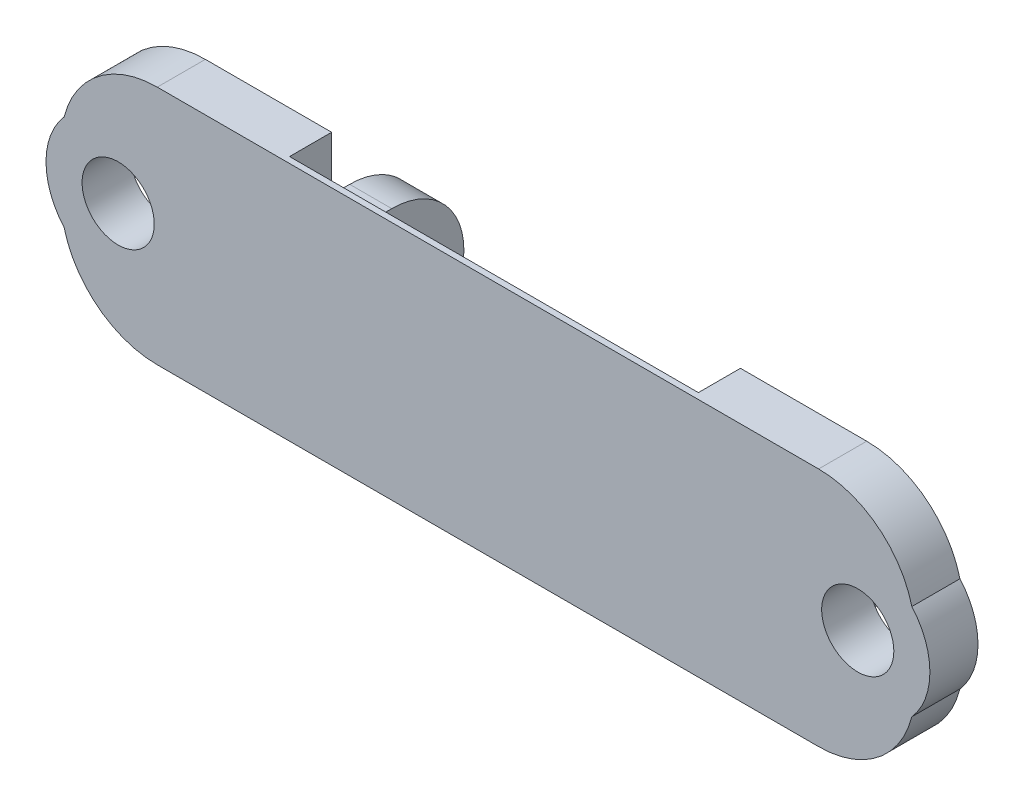
ISO-10303-21;
HEADER;
FILE_DESCRIPTION(('STEP AP214'),'2;1');
FILE_NAME('part.step','',(''),(''),'','','');
FILE_SCHEMA(('AUTOMOTIVE_DESIGN { 1 0 10303 214 1 1 1 1 }'));
ENDSEC;
DATA;
#1=APPLICATION_CONTEXT('core data for automotive mechanical design processes');
#2=APPLICATION_PROTOCOL_DEFINITION('international standard','automotive_design',2000,#1);
#3=PRODUCT_CONTEXT('',#1,'mechanical');
#4=PRODUCT('Part','Part','',(#3));
#5=PRODUCT_RELATED_PRODUCT_CATEGORY('part','',(#4));
#6=PRODUCT_DEFINITION_FORMATION('','',#4);
#7=PRODUCT_DEFINITION_CONTEXT('part definition',#1,'design');
#8=PRODUCT_DEFINITION('design','',#6,#7);
#9=PRODUCT_DEFINITION_SHAPE('','',#8);
#10=(LENGTH_UNIT() NAMED_UNIT(*) SI_UNIT(.MILLI.,.METRE.));
#11=(NAMED_UNIT(*) PLANE_ANGLE_UNIT() SI_UNIT($,.RADIAN.));
#12=(NAMED_UNIT(*) SI_UNIT($,.STERADIAN.) SOLID_ANGLE_UNIT());
#13=UNCERTAINTY_MEASURE_WITH_UNIT(LENGTH_MEASURE(1.E-05),#10,'distance_accuracy_value','');
#14=(GEOMETRIC_REPRESENTATION_CONTEXT(3) GLOBAL_UNCERTAINTY_ASSIGNED_CONTEXT((#13)) GLOBAL_UNIT_ASSIGNED_CONTEXT((#10,
#11,#12)) REPRESENTATION_CONTEXT('',''));
#15=CARTESIAN_POINT('',(0.,0.,0.));
#16=DIRECTION('',(0.,0.,1.));
#17=DIRECTION('',(1.,0.,0.));
#18=AXIS2_PLACEMENT_3D('',#15,#16,#17);
#19=CARTESIAN_POINT('',(0.,0.,-4.));
#20=DIRECTION('',(0.,0.,1.));
#21=DIRECTION('',(1.,0.,0.));
#22=AXIS2_PLACEMENT_3D('',#19,#20,#21);
#23=PLANE('',#22);
#24=CARTESIAN_POINT('',(66.254,10.,-4.));
#25=DIRECTION('',(0.,0.,1.));
#26=DIRECTION('',(1.,0.,0.));
#27=AXIS2_PLACEMENT_3D('',#24,#25,#26);
#28=CIRCLE('',#27,3.00000000000001);
#29=CARTESIAN_POINT('',(69.254,10.,-4.));
#30=VERTEX_POINT('',#29);
#31=EDGE_CURVE('E248',#30,#30,#28,.F.);
#32=ORIENTED_EDGE('',*,*,#31,.F.);
#33=EDGE_LOOP('',(#32));
#34=FACE_BOUND('',#33,.T.);
#35=DIRECTION('',(0.,-1.,0.));
#36=VECTOR('',#35,1.);
#37=CARTESIAN_POINT('',(56.,12.,-4.));
#38=LINE('',#37,#36);
#39=CARTESIAN_POINT('',(56.,12.,-4.));
#40=VERTEX_POINT('',#39);
#41=CARTESIAN_POINT('',(56.,0.,-4.));
#42=VERTEX_POINT('',#41);
#43=EDGE_CURVE('E166',#40,#42,#38,.T.);
#44=ORIENTED_EDGE('',*,*,#43,.F.);
#45=DIRECTION('',(-1.,0.,0.));
#46=VECTOR('',#45,1.);
#47=CARTESIAN_POINT('',(56.,12.,-4.));
#48=LINE('',#47,#46);
#49=CARTESIAN_POINT('',(52.5,12.,-4.));
#50=VERTEX_POINT('',#49);
#51=EDGE_CURVE('E53',#40,#50,#48,.T.);
#52=ORIENTED_EDGE('',*,*,#51,.T.);
#53=DIRECTION('',(0.,1.,0.));
#54=VECTOR('',#53,1.);
#55=CARTESIAN_POINT('',(52.5,0.,-4.));
#56=LINE('',#55,#54);
#57=CARTESIAN_POINT('',(52.5,20.,-4.));
#58=VERTEX_POINT('',#57);
#59=EDGE_CURVE('E242',#50,#58,#56,.T.);
#60=ORIENTED_EDGE('',*,*,#59,.T.);
#61=DIRECTION('',(1.,0.,0.));
#62=VECTOR('',#61,1.);
#63=CARTESIAN_POINT('',(0.,20.,-4.));
#64=LINE('',#63,#62);
#65=CARTESIAN_POINT('',(62.9999999999999,20.,-4.));
#66=VERTEX_POINT('',#65);
#67=EDGE_CURVE('E240',#58,#66,#64,.T.);
#68=ORIENTED_EDGE('',*,*,#67,.T.);
#69=CARTESIAN_POINT('',(63.,12.,-4.));
#70=DIRECTION('',(0.,0.,1.));
#71=DIRECTION('',(1.,0.,0.));
#72=AXIS2_PLACEMENT_3D('',#69,#70,#71);
#73=CIRCLE('',#72,8.);
#74=CARTESIAN_POINT('',(70.7539992634981,13.9686278017114,-4.));
#75=VERTEX_POINT('',#74);
#76=EDGE_CURVE('E237',#66,#75,#73,.F.);
#77=ORIENTED_EDGE('',*,*,#76,.T.);
#78=CARTESIAN_POINT('',(66.254,10.,-4.));
#79=DIRECTION('',(0.,0.,1.));
#80=DIRECTION('',(1.,0.,0.));
#81=AXIS2_PLACEMENT_3D('',#78,#79,#80);
#82=CIRCLE('',#81,6.00000000000001);
#83=CARTESIAN_POINT('',(70.7539992634981,6.0313721982886,-4.));
#84=VERTEX_POINT('',#83);
#85=EDGE_CURVE('E235',#75,#84,#82,.F.);
#86=ORIENTED_EDGE('',*,*,#85,.T.);
#87=CARTESIAN_POINT('',(63.,8.,-4.));
#88=DIRECTION('',(0.,0.,1.));
#89=DIRECTION('',(1.,0.,0.));
#90=AXIS2_PLACEMENT_3D('',#87,#88,#89);
#91=CIRCLE('',#90,8.);
#92=CARTESIAN_POINT('',(62.9999999999999,0.,-4.));
#93=VERTEX_POINT('',#92);
#94=EDGE_CURVE('E245',#93,#84,#91,.T.);
#95=ORIENTED_EDGE('',*,*,#94,.F.);
#96=DIRECTION('',(1.,0.,0.));
#97=VECTOR('',#96,1.);
#98=CARTESIAN_POINT('',(0.,0.,-4.));
#99=LINE('',#98,#97);
#100=EDGE_CURVE('E59',#42,#93,#99,.T.);
#101=ORIENTED_EDGE('',*,*,#100,.F.);
#102=EDGE_LOOP('',(#44,#52,#60,#68,#77,#86,#95,#101));
#103=FACE_BOUND('',#102,.T.);
#104=ADVANCED_FACE('F35',(#34,#103),#23,.F.);
#105=CARTESIAN_POINT('',(0.,0.,-2.));
#106=DIRECTION('',(0.,0.,1.));
#107=DIRECTION('',(1.,0.,0.));
#108=AXIS2_PLACEMENT_3D('',#105,#106,#107);
#109=PLANE('',#108);
#110=DIRECTION('',(-1.,0.,0.));
#111=VECTOR('',#110,1.);
#112=CARTESIAN_POINT('',(52.5,7.70719,-2.));
#113=LINE('',#112,#111);
#114=CARTESIAN_POINT('',(52.5,7.70719,-2.));
#115=VERTEX_POINT('',#114);
#116=CARTESIAN_POINT('',(18.5,7.70719,-2.));
#117=VERTEX_POINT('',#116);
#118=EDGE_CURVE('E227',#115,#117,#113,.T.);
#119=ORIENTED_EDGE('',*,*,#118,.F.);
#120=DIRECTION('',(0.,1.,0.));
#121=VECTOR('',#120,1.);
#122=CARTESIAN_POINT('',(52.5,0.,-2.));
#123=LINE('',#122,#121);
#124=CARTESIAN_POINT('',(52.5,0.,-2.));
#125=VERTEX_POINT('',#124);
#126=EDGE_CURVE('E281',#125,#115,#123,.T.);
#127=ORIENTED_EDGE('',*,*,#126,.F.);
#128=DIRECTION('',(1.,0.,0.));
#129=VECTOR('',#128,1.);
#130=CARTESIAN_POINT('',(0.,0.,-2.));
#131=LINE('',#130,#129);
#132=CARTESIAN_POINT('',(18.5,0.,-2.));
#133=VERTEX_POINT('',#132);
#134=EDGE_CURVE('E263',#133,#125,#131,.T.);
#135=ORIENTED_EDGE('',*,*,#134,.F.);
#136=DIRECTION('',(0.,-1.,0.));
#137=VECTOR('',#136,1.);
#138=CARTESIAN_POINT('',(18.5,0.,-2.));
#139=LINE('',#138,#137);
#140=EDGE_CURVE('E39',#117,#133,#139,.T.);
#141=ORIENTED_EDGE('',*,*,#140,.F.);
#142=EDGE_LOOP('',(#119,#127,#135,#141));
#143=FACE_BOUND('',#142,.T.);
#144=ADVANCED_FACE('F387',(#143),#109,.F.);
#145=CARTESIAN_POINT('',(8.,12.,-4.));
#146=DIRECTION('',(0.,0.,1.));
#147=DIRECTION('',(1.,0.,0.));
#148=AXIS2_PLACEMENT_3D('',#145,#146,#147);
#149=CYLINDRICAL_SURFACE('',#148,8.);
#150=CARTESIAN_POINT('',(8.,12.,0.));
#151=DIRECTION('',(0.,0.,1.));
#152=DIRECTION('',(1.,0.,0.));
#153=AXIS2_PLACEMENT_3D('',#150,#151,#152);
#154=CIRCLE('',#153,8.);
#155=CARTESIAN_POINT('',(0.246000736501909,13.9686278017114,0.));
#156=VERTEX_POINT('',#155);
#157=CARTESIAN_POINT('',(8.00000000000006,20.,0.));
#158=VERTEX_POINT('',#157);
#159=EDGE_CURVE('E315',#156,#158,#154,.F.);
#160=ORIENTED_EDGE('',*,*,#159,.T.);
#161=DIRECTION('',(0.,0.,1.));
#162=VECTOR('',#161,1.);
#163=CARTESIAN_POINT('',(8.00000000000006,20.,-4.));
#164=LINE('',#163,#162);
#165=CARTESIAN_POINT('',(8.00000000000006,20.,-4.));
#166=VERTEX_POINT('',#165);
#167=EDGE_CURVE('E11',#166,#158,#164,.T.);
#168=ORIENTED_EDGE('',*,*,#167,.F.);
#169=CARTESIAN_POINT('',(8.,12.,-4.));
#170=DIRECTION('',(0.,0.,1.));
#171=DIRECTION('',(1.,0.,0.));
#172=AXIS2_PLACEMENT_3D('',#169,#170,#171);
#173=CIRCLE('',#172,8.);
#174=CARTESIAN_POINT('',(0.246000736501909,13.9686278017114,-4.));
#175=VERTEX_POINT('',#174);
#176=EDGE_CURVE('E328',#175,#166,#173,.F.);
#177=ORIENTED_EDGE('',*,*,#176,.F.);
#178=DIRECTION('',(0.,0.,1.));
#179=VECTOR('',#178,1.);
#180=CARTESIAN_POINT('',(0.246000736501909,13.9686278017114,-4.));
#181=LINE('',#180,#179);
#182=EDGE_CURVE('E300',#175,#156,#181,.T.);
#183=ORIENTED_EDGE('',*,*,#182,.T.);
#184=EDGE_LOOP('',(#160,#168,#177,#183));
#185=FACE_BOUND('',#184,.T.);
#186=ADVANCED_FACE('F37',(#185),#149,.T.);
#187=CARTESIAN_POINT('',(0.,20.,-4.));
#188=DIRECTION('',(0.,-1.,0.));
#189=DIRECTION('',(0.,0.,-1.));
#190=AXIS2_PLACEMENT_3D('',#187,#188,#189);
#191=PLANE('',#190);
#192=DIRECTION('',(0.,0.,1.));
#193=VECTOR('',#192,1.);
#194=CARTESIAN_POINT('',(52.5,20.,-4.));
#195=LINE('',#194,#193);
#196=CARTESIAN_POINT('',(52.5,20.,-0.5));
#197=VERTEX_POINT('',#196);
#198=EDGE_CURVE('E276',#58,#197,#195,.T.);
#199=ORIENTED_EDGE('',*,*,#198,.T.);
#200=DIRECTION('',(-1.,0.,0.));
#201=VECTOR('',#200,1.);
#202=CARTESIAN_POINT('',(52.5,20.,-0.5));
#203=LINE('',#202,#201);
#204=CARTESIAN_POINT('',(18.5,20.,-0.5));
#205=VERTEX_POINT('',#204);
#206=EDGE_CURVE('E231',#197,#205,#203,.T.);
#207=ORIENTED_EDGE('',*,*,#206,.T.);
#208=DIRECTION('',(0.,0.,1.));
#209=VECTOR('',#208,1.);
#210=CARTESIAN_POINT('',(18.5,20.,-4.));
#211=LINE('',#210,#209);
#212=CARTESIAN_POINT('',(18.5,20.,-4.));
#213=VERTEX_POINT('',#212);
#214=EDGE_CURVE('E45',#213,#205,#211,.T.);
#215=ORIENTED_EDGE('',*,*,#214,.F.);
#216=DIRECTION('',(1.,0.,0.));
#217=VECTOR('',#216,1.);
#218=CARTESIAN_POINT('',(0.,20.,-4.));
#219=LINE('',#218,#217);
#220=EDGE_CURVE('E307',#166,#213,#219,.T.);
#221=ORIENTED_EDGE('',*,*,#220,.F.);
#222=ORIENTED_EDGE('',*,*,#167,.T.);
#223=DIRECTION('',(1.,0.,0.));
#224=VECTOR('',#223,1.);
#225=CARTESIAN_POINT('',(0.,20.,0.));
#226=LINE('',#225,#224);
#227=CARTESIAN_POINT('',(62.9999999999999,20.,0.));
#228=VERTEX_POINT('',#227);
#229=EDGE_CURVE('E325',#158,#228,#226,.T.);
#230=ORIENTED_EDGE('',*,*,#229,.T.);
#231=DIRECTION('',(0.,0.,1.));
#232=VECTOR('',#231,1.);
#233=CARTESIAN_POINT('',(62.9999999999999,20.,-4.));
#234=LINE('',#233,#232);
#235=EDGE_CURVE('E417',#66,#228,#234,.T.);
#236=ORIENTED_EDGE('',*,*,#235,.F.);
#237=ORIENTED_EDGE('',*,*,#67,.F.);
#238=EDGE_LOOP('',(#199,#207,#215,#221,#222,#230,#236,#237));
#239=FACE_BOUND('',#238,.T.);
#240=ADVANCED_FACE('F375',(#239),#191,.F.);
#241=CARTESIAN_POINT('',(18.5,0.,-4.));
#242=DIRECTION('',(-1.,0.,0.));
#243=DIRECTION('',(0.,0.,1.));
#244=AXIS2_PLACEMENT_3D('',#241,#242,#243);
#245=PLANE('',#244);
#246=ORIENTED_EDGE('',*,*,#214,.T.);
#247=DIRECTION('',(0.,-0.992637367062776,-0.12112414090791));
#248=VECTOR('',#247,1.);
#249=CARTESIAN_POINT('',(18.5,20.,-0.5));
#250=LINE('',#249,#248);
#251=EDGE_CURVE('E220',#205,#117,#250,.T.);
#252=ORIENTED_EDGE('',*,*,#251,.T.);
#253=ORIENTED_EDGE('',*,*,#140,.T.);
#254=DIRECTION('',(0.,0.,1.));
#255=VECTOR('',#254,1.);
#256=CARTESIAN_POINT('',(18.5,0.,-4.));
#257=LINE('',#256,#255);
#258=CARTESIAN_POINT('',(18.5,0.,-9.));
#259=VERTEX_POINT('',#258);
#260=EDGE_CURVE('E290',#259,#133,#257,.T.);
#261=ORIENTED_EDGE('',*,*,#260,.F.);
#262=CARTESIAN_POINT('',(18.5,6.,-9.));
#263=DIRECTION('',(1.,0.,0.));
#264=DIRECTION('',(0.,0.,-1.));
#265=AXIS2_PLACEMENT_3D('',#262,#263,#264);
#266=CIRCLE('',#265,6.);
#267=CARTESIAN_POINT('',(18.5,12.,-9.));
#268=VERTEX_POINT('',#267);
#269=EDGE_CURVE('E196',#259,#268,#266,.T.);
#270=ORIENTED_EDGE('',*,*,#269,.T.);
#271=DIRECTION('',(0.,0.,1.));
#272=VECTOR('',#271,1.);
#273=CARTESIAN_POINT('',(18.5,12.,-9.));
#274=LINE('',#273,#272);
#275=CARTESIAN_POINT('',(18.5,12.,-4.));
#276=VERTEX_POINT('',#275);
#277=EDGE_CURVE('E203',#268,#276,#274,.T.);
#278=ORIENTED_EDGE('',*,*,#277,.T.);
#279=DIRECTION('',(0.,-1.,0.));
#280=VECTOR('',#279,1.);
#281=CARTESIAN_POINT('',(18.5,0.,-4.));
#282=LINE('',#281,#280);
#283=EDGE_CURVE('E311',#213,#276,#282,.T.);
#284=ORIENTED_EDGE('',*,*,#283,.F.);
#285=EDGE_LOOP('',(#246,#252,#253,#261,#270,#278,#284));
#286=FACE_BOUND('',#285,.T.);
#287=CARTESIAN_POINT('',(18.5,6.,-9.));
#288=DIRECTION('',(1.,0.,0.));
#289=DIRECTION('',(0.,0.,-1.));
#290=AXIS2_PLACEMENT_3D('',#287,#288,#289);
#291=CIRCLE('',#290,3.);
#292=CARTESIAN_POINT('',(18.5,6.,-12.));
#293=VERTEX_POINT('',#292);
#294=EDGE_CURVE('E197',#293,#293,#291,.T.);
#295=ORIENTED_EDGE('',*,*,#294,.F.);
#296=EDGE_LOOP('',(#295));
#297=FACE_BOUND('',#296,.T.);
#298=ADVANCED_FACE('F352',(#286,#297),#245,.F.);
#299=CARTESIAN_POINT('',(0.,0.,-4.));
#300=DIRECTION('',(0.,-1.,0.));
#301=DIRECTION('',(0.,0.,-1.));
#302=AXIS2_PLACEMENT_3D('',#299,#300,#301);
#303=PLANE('',#302);
#304=DIRECTION('',(1.,0.,0.));
#305=VECTOR('',#304,1.);
#306=CARTESIAN_POINT('',(0.,0.,0.));
#307=LINE('',#306,#305);
#308=CARTESIAN_POINT('',(8.00000000000006,0.,0.));
#309=VERTEX_POINT('',#308);
#310=CARTESIAN_POINT('',(62.9999999999999,0.,0.));
#311=VERTEX_POINT('',#310);
#312=EDGE_CURVE('E323',#309,#311,#307,.T.);
#313=ORIENTED_EDGE('',*,*,#312,.F.);
#314=DIRECTION('',(0.,0.,1.));
#315=VECTOR('',#314,1.);
#316=CARTESIAN_POINT('',(8.00000000000006,0.,-4.));
#317=LINE('',#316,#315);
#318=CARTESIAN_POINT('',(8.00000000000006,0.,-4.));
#319=VERTEX_POINT('',#318);
#320=EDGE_CURVE('E297',#319,#309,#317,.T.);
#321=ORIENTED_EDGE('',*,*,#320,.F.);
#322=DIRECTION('',(1.,0.,0.));
#323=VECTOR('',#322,1.);
#324=CARTESIAN_POINT('',(0.,0.,-4.));
#325=LINE('',#324,#323);
#326=CARTESIAN_POINT('',(15.,0.,-4.));
#327=VERTEX_POINT('',#326);
#328=EDGE_CURVE('E341',#319,#327,#325,.T.);
#329=ORIENTED_EDGE('',*,*,#328,.T.);
#330=DIRECTION('',(0.,0.,-1.));
#331=VECTOR('',#330,1.);
#332=CARTESIAN_POINT('',(15.,0.,-4.));
#333=LINE('',#332,#331);
#334=CARTESIAN_POINT('',(15.,0.,-9.));
#335=VERTEX_POINT('',#334);
#336=EDGE_CURVE('E202',#327,#335,#333,.T.);
#337=ORIENTED_EDGE('',*,*,#336,.T.);
#338=DIRECTION('',(1.,0.,0.));
#339=VECTOR('',#338,1.);
#340=CARTESIAN_POINT('',(15.,0.,-9.));
#341=LINE('',#340,#339);
#342=EDGE_CURVE('E212',#335,#259,#341,.T.);
#343=ORIENTED_EDGE('',*,*,#342,.T.);
#344=ORIENTED_EDGE('',*,*,#260,.T.);
#345=ORIENTED_EDGE('',*,*,#134,.T.);
#346=DIRECTION('',(0.,0.,1.));
#347=VECTOR('',#346,1.);
#348=CARTESIAN_POINT('',(52.5,0.,-4.));
#349=LINE('',#348,#347);
#350=CARTESIAN_POINT('',(52.5,0.,-9.));
#351=VERTEX_POINT('',#350);
#352=EDGE_CURVE('E267',#351,#125,#349,.T.);
#353=ORIENTED_EDGE('',*,*,#352,.F.);
#354=DIRECTION('',(-1.,0.,0.));
#355=VECTOR('',#354,1.);
#356=CARTESIAN_POINT('',(56.,0.,-9.));
#357=LINE('',#356,#355);
#358=CARTESIAN_POINT('',(56.,0.,-9.));
#359=VERTEX_POINT('',#358);
#360=EDGE_CURVE('E188',#359,#351,#357,.T.);
#361=ORIENTED_EDGE('',*,*,#360,.F.);
#362=DIRECTION('',(0.,0.,-1.));
#363=VECTOR('',#362,1.);
#364=CARTESIAN_POINT('',(56.,0.,-4.));
#365=LINE('',#364,#363);
#366=EDGE_CURVE('E186',#42,#359,#365,.T.);
#367=ORIENTED_EDGE('',*,*,#366,.F.);
#368=ORIENTED_EDGE('',*,*,#100,.T.);
#369=DIRECTION('',(0.,0.,1.));
#370=VECTOR('',#369,1.);
#371=CARTESIAN_POINT('',(62.9999999999999,0.,-4.));
#372=LINE('',#371,#370);
#373=EDGE_CURVE('E264',#93,#311,#372,.T.);
#374=ORIENTED_EDGE('',*,*,#373,.T.);
#375=EDGE_LOOP('',(#313,#321,#329,#337,#343,#344,#345,#353,#361,#367,#368,#374));
#376=FACE_BOUND('',#375,.T.);
#377=ADVANCED_FACE('F365',(#376),#303,.T.);
#378=CARTESIAN_POINT('',(8.,8.,-4.));
#379=DIRECTION('',(0.,0.,1.));
#380=DIRECTION('',(1.,0.,0.));
#381=AXIS2_PLACEMENT_3D('',#378,#379,#380);
#382=CYLINDRICAL_SURFACE('',#381,8.);
#383=CARTESIAN_POINT('',(8.,8.,0.));
#384=DIRECTION('',(0.,0.,1.));
#385=DIRECTION('',(1.,0.,0.));
#386=AXIS2_PLACEMENT_3D('',#383,#384,#385);
#387=CIRCLE('',#386,8.);
#388=CARTESIAN_POINT('',(0.246000736501909,6.0313721982886,0.));
#389=VERTEX_POINT('',#388);
#390=EDGE_CURVE('E320',#309,#389,#387,.F.);
#391=ORIENTED_EDGE('',*,*,#390,.T.);
#392=DIRECTION('',(0.,0.,1.));
#393=VECTOR('',#392,1.);
#394=CARTESIAN_POINT('',(0.246000736501909,6.0313721982886,-4.));
#395=LINE('',#394,#393);
#396=CARTESIAN_POINT('',(0.246000736501909,6.0313721982886,-4.));
#397=VERTEX_POINT('',#396);
#398=EDGE_CURVE('E299',#397,#389,#395,.T.);
#399=ORIENTED_EDGE('',*,*,#398,.F.);
#400=CARTESIAN_POINT('',(8.,8.,-4.));
#401=DIRECTION('',(0.,0.,1.));
#402=DIRECTION('',(1.,0.,0.));
#403=AXIS2_PLACEMENT_3D('',#400,#401,#402);
#404=CIRCLE('',#403,8.);
#405=EDGE_CURVE('E337',#319,#397,#404,.F.);
#406=ORIENTED_EDGE('',*,*,#405,.F.);
#407=ORIENTED_EDGE('',*,*,#320,.T.);
#408=EDGE_LOOP('',(#391,#399,#406,#407));
#409=FACE_BOUND('',#408,.T.);
#410=ADVANCED_FACE('F370',(#409),#382,.T.);
#411=CARTESIAN_POINT('',(4.746,10.,-4.));
#412=DIRECTION('',(0.,0.,1.));
#413=DIRECTION('',(1.,0.,0.));
#414=AXIS2_PLACEMENT_3D('',#411,#412,#413);
#415=CYLINDRICAL_SURFACE('',#414,6.);
#416=CARTESIAN_POINT('',(4.746,10.,0.));
#417=DIRECTION('',(0.,0.,1.));
#418=DIRECTION('',(1.,0.,0.));
#419=AXIS2_PLACEMENT_3D('',#416,#417,#418);
#420=CIRCLE('',#419,6.);
#421=EDGE_CURVE('E317',#156,#389,#420,.T.);
#422=ORIENTED_EDGE('',*,*,#421,.F.);
#423=ORIENTED_EDGE('',*,*,#182,.F.);
#424=CARTESIAN_POINT('',(4.746,10.,-4.));
#425=DIRECTION('',(0.,0.,1.));
#426=DIRECTION('',(1.,0.,0.));
#427=AXIS2_PLACEMENT_3D('',#424,#425,#426);
#428=CIRCLE('',#427,6.);
#429=EDGE_CURVE('E332',#175,#397,#428,.T.);
#430=ORIENTED_EDGE('',*,*,#429,.T.);
#431=ORIENTED_EDGE('',*,*,#398,.T.);
#432=EDGE_LOOP('',(#422,#423,#430,#431));
#433=FACE_BOUND('',#432,.T.);
#434=ADVANCED_FACE('F373',(#433),#415,.T.);
#435=CARTESIAN_POINT('',(4.746,10.,-4.));
#436=DIRECTION('',(0.,0.,1.));
#437=DIRECTION('',(1.,0.,0.));
#438=AXIS2_PLACEMENT_3D('',#435,#436,#437);
#439=CYLINDRICAL_SURFACE('',#438,3.);
#440=CARTESIAN_POINT('',(4.746,10.,-4.));
#441=DIRECTION('',(0.,0.,1.));
#442=DIRECTION('',(1.,0.,0.));
#443=AXIS2_PLACEMENT_3D('',#440,#441,#442);
#444=CIRCLE('',#443,3.);
#445=CARTESIAN_POINT('',(7.746,10.,-4.));
#446=VERTEX_POINT('',#445);
#447=EDGE_CURVE('E301',#446,#446,#444,.T.);
#448=ORIENTED_EDGE('',*,*,#447,.F.);
#449=EDGE_LOOP('',(#448));
#450=FACE_BOUND('',#449,.T.);
#451=CARTESIAN_POINT('',(4.746,10.,0.));
#452=DIRECTION('',(0.,0.,1.));
#453=DIRECTION('',(1.,0.,0.));
#454=AXIS2_PLACEMENT_3D('',#451,#452,#453);
#455=CIRCLE('',#454,3.);
#456=CARTESIAN_POINT('',(7.746,10.,0.));
#457=VERTEX_POINT('',#456);
#458=EDGE_CURVE('E326',#457,#457,#455,.T.);
#459=ORIENTED_EDGE('',*,*,#458,.T.);
#460=EDGE_LOOP('',(#459));
#461=FACE_BOUND('',#460,.T.);
#462=ADVANCED_FACE('F451',(#450,#461),#439,.F.);
#463=CARTESIAN_POINT('',(0.,0.,-4.));
#464=DIRECTION('',(0.,0.,1.));
#465=DIRECTION('',(1.,0.,0.));
#466=AXIS2_PLACEMENT_3D('',#463,#464,#465);
#467=PLANE('',#466);
#468=ORIENTED_EDGE('',*,*,#283,.T.);
#469=DIRECTION('',(1.,0.,0.));
#470=VECTOR('',#469,1.);
#471=CARTESIAN_POINT('',(15.,12.,-4.));
#472=LINE('',#471,#470);
#473=CARTESIAN_POINT('',(15.,12.,-4.));
#474=VERTEX_POINT('',#473);
#475=EDGE_CURVE('E217',#474,#276,#472,.T.);
#476=ORIENTED_EDGE('',*,*,#475,.F.);
#477=DIRECTION('',(0.,-1.,0.));
#478=VECTOR('',#477,1.);
#479=CARTESIAN_POINT('',(15.,12.,-4.));
#480=LINE('',#479,#478);
#481=EDGE_CURVE('E200',#474,#327,#480,.T.);
#482=ORIENTED_EDGE('',*,*,#481,.T.);
#483=ORIENTED_EDGE('',*,*,#328,.F.);
#484=ORIENTED_EDGE('',*,*,#405,.T.);
#485=ORIENTED_EDGE('',*,*,#429,.F.);
#486=ORIENTED_EDGE('',*,*,#176,.T.);
#487=ORIENTED_EDGE('',*,*,#220,.T.);
#488=EDGE_LOOP('',(#468,#476,#482,#483,#484,#485,#486,#487));
#489=FACE_BOUND('',#488,.T.);
#490=ORIENTED_EDGE('',*,*,#447,.T.);
#491=EDGE_LOOP('',(#490));
#492=FACE_BOUND('',#491,.T.);
#493=ADVANCED_FACE('F344',(#489,#492),#467,.F.);
#494=CARTESIAN_POINT('',(0.,0.,0.));
#495=DIRECTION('',(0.,0.,1.));
#496=DIRECTION('',(1.,0.,0.));
#497=AXIS2_PLACEMENT_3D('',#494,#495,#496);
#498=PLANE('',#497);
#499=ORIENTED_EDGE('',*,*,#159,.F.);
#500=ORIENTED_EDGE('',*,*,#421,.T.);
#501=ORIENTED_EDGE('',*,*,#390,.F.);
#502=ORIENTED_EDGE('',*,*,#312,.T.);
#503=CARTESIAN_POINT('',(63.,8.,0.));
#504=DIRECTION('',(0.,0.,1.));
#505=DIRECTION('',(1.,0.,0.));
#506=AXIS2_PLACEMENT_3D('',#503,#504,#505);
#507=CIRCLE('',#506,8.);
#508=CARTESIAN_POINT('',(70.7539992634981,6.0313721982886,0.));
#509=VERTEX_POINT('',#508);
#510=EDGE_CURVE('E256',#311,#509,#507,.T.);
#511=ORIENTED_EDGE('',*,*,#510,.T.);
#512=CARTESIAN_POINT('',(66.254,10.,0.));
#513=DIRECTION('',(0.,0.,1.));
#514=DIRECTION('',(1.,0.,0.));
#515=AXIS2_PLACEMENT_3D('',#512,#513,#514);
#516=CIRCLE('',#515,6.00000000000001);
#517=CARTESIAN_POINT('',(70.7539992634981,13.9686278017114,0.));
#518=VERTEX_POINT('',#517);
#519=EDGE_CURVE('E234',#518,#509,#516,.F.);
#520=ORIENTED_EDGE('',*,*,#519,.F.);
#521=CARTESIAN_POINT('',(63.,12.,0.));
#522=DIRECTION('',(0.,0.,1.));
#523=DIRECTION('',(1.,0.,0.));
#524=AXIS2_PLACEMENT_3D('',#521,#522,#523);
#525=CIRCLE('',#524,8.);
#526=EDGE_CURVE('E254',#228,#518,#525,.F.);
#527=ORIENTED_EDGE('',*,*,#526,.F.);
#528=ORIENTED_EDGE('',*,*,#229,.F.);
#529=EDGE_LOOP('',(#499,#500,#501,#502,#511,#520,#527,#528));
#530=FACE_BOUND('',#529,.T.);
#531=ORIENTED_EDGE('',*,*,#458,.F.);
#532=EDGE_LOOP('',(#531));
#533=FACE_BOUND('',#532,.T.);
#534=CARTESIAN_POINT('',(66.254,10.,0.));
#535=DIRECTION('',(0.,0.,1.));
#536=DIRECTION('',(1.,0.,0.));
#537=AXIS2_PLACEMENT_3D('',#534,#535,#536);
#538=CIRCLE('',#537,3.00000000000001);
#539=CARTESIAN_POINT('',(69.254,10.,0.));
#540=VERTEX_POINT('',#539);
#541=EDGE_CURVE('E238',#540,#540,#538,.F.);
#542=ORIENTED_EDGE('',*,*,#541,.T.);
#543=EDGE_LOOP('',(#542));
#544=FACE_BOUND('',#543,.T.);
#545=ADVANCED_FACE('F413',(#530,#533,#544),#498,.T.);
#546=CARTESIAN_POINT('',(52.5,0.,-4.));
#547=DIRECTION('',(1.,0.,0.));
#548=DIRECTION('',(0.,0.,-1.));
#549=AXIS2_PLACEMENT_3D('',#546,#547,#548);
#550=PLANE('',#549);
#551=ORIENTED_EDGE('',*,*,#352,.T.);
#552=ORIENTED_EDGE('',*,*,#126,.T.);
#553=DIRECTION('',(0.,-0.992637367062776,-0.12112414090791));
#554=VECTOR('',#553,1.);
#555=CARTESIAN_POINT('',(52.5,20.,-0.5));
#556=LINE('',#555,#554);
#557=EDGE_CURVE('E225',#197,#115,#556,.T.);
#558=ORIENTED_EDGE('',*,*,#557,.F.);
#559=ORIENTED_EDGE('',*,*,#198,.F.);
#560=ORIENTED_EDGE('',*,*,#59,.F.);
#561=DIRECTION('',(0.,0.,1.));
#562=VECTOR('',#561,1.);
#563=CARTESIAN_POINT('',(52.5,12.,-9.));
#564=LINE('',#563,#562);
#565=CARTESIAN_POINT('',(52.5,12.,-9.));
#566=VERTEX_POINT('',#565);
#567=EDGE_CURVE('E184',#566,#50,#564,.T.);
#568=ORIENTED_EDGE('',*,*,#567,.F.);
#569=CARTESIAN_POINT('',(52.5,6.,-9.));
#570=DIRECTION('',(1.,0.,0.));
#571=DIRECTION('',(0.,0.,-1.));
#572=AXIS2_PLACEMENT_3D('',#569,#570,#571);
#573=CIRCLE('',#572,6.);
#574=EDGE_CURVE('E170',#351,#566,#573,.T.);
#575=ORIENTED_EDGE('',*,*,#574,.F.);
#576=EDGE_LOOP('',(#551,#552,#558,#559,#560,#568,#575));
#577=FACE_BOUND('',#576,.T.);
#578=CARTESIAN_POINT('',(52.5,6.,-9.));
#579=DIRECTION('',(1.,0.,0.));
#580=DIRECTION('',(0.,0.,-1.));
#581=AXIS2_PLACEMENT_3D('',#578,#579,#580);
#582=CIRCLE('',#581,3.);
#583=CARTESIAN_POINT('',(52.5,6.,-12.));
#584=VERTEX_POINT('',#583);
#585=EDGE_CURVE('E576',#584,#584,#582,.T.);
#586=ORIENTED_EDGE('',*,*,#585,.T.);
#587=EDGE_LOOP('',(#586));
#588=FACE_BOUND('',#587,.T.);
#589=ADVANCED_FACE('F392',(#577,#588),#550,.F.);
#590=CARTESIAN_POINT('',(66.254,10.,-4.));
#591=DIRECTION('',(0.,0.,1.));
#592=DIRECTION('',(1.,0.,0.));
#593=AXIS2_PLACEMENT_3D('',#590,#591,#592);
#594=CYLINDRICAL_SURFACE('',#593,6.00000000000001);
#595=ORIENTED_EDGE('',*,*,#519,.T.);
#596=DIRECTION('',(0.,0.,1.));
#597=VECTOR('',#596,1.);
#598=CARTESIAN_POINT('',(70.7539992634981,6.0313721982886,-4.));
#599=LINE('',#598,#597);
#600=EDGE_CURVE('E261',#84,#509,#599,.T.);
#601=ORIENTED_EDGE('',*,*,#600,.F.);
#602=ORIENTED_EDGE('',*,*,#85,.F.);
#603=DIRECTION('',(0.,0.,1.));
#604=VECTOR('',#603,1.);
#605=CARTESIAN_POINT('',(70.7539992634981,13.9686278017114,-4.));
#606=LINE('',#605,#604);
#607=EDGE_CURVE('E251',#75,#518,#606,.T.);
#608=ORIENTED_EDGE('',*,*,#607,.T.);
#609=EDGE_LOOP('',(#595,#601,#602,#608));
#610=FACE_BOUND('',#609,.T.);
#611=ADVANCED_FACE('F409',(#610),#594,.T.);
#612=CARTESIAN_POINT('',(63.,8.,-4.));
#613=DIRECTION('',(0.,0.,1.));
#614=DIRECTION('',(1.,0.,0.));
#615=AXIS2_PLACEMENT_3D('',#612,#613,#614);
#616=CYLINDRICAL_SURFACE('',#615,8.);
#617=ORIENTED_EDGE('',*,*,#510,.F.);
#618=ORIENTED_EDGE('',*,*,#373,.F.);
#619=ORIENTED_EDGE('',*,*,#94,.T.);
#620=ORIENTED_EDGE('',*,*,#600,.T.);
#621=EDGE_LOOP('',(#617,#618,#619,#620));
#622=FACE_BOUND('',#621,.T.);
#623=ADVANCED_FACE('F402',(#622),#616,.T.);
#624=CARTESIAN_POINT('',(63.,12.,-4.));
#625=DIRECTION('',(0.,0.,1.));
#626=DIRECTION('',(1.,0.,0.));
#627=AXIS2_PLACEMENT_3D('',#624,#625,#626);
#628=CYLINDRICAL_SURFACE('',#627,8.);
#629=ORIENTED_EDGE('',*,*,#526,.T.);
#630=ORIENTED_EDGE('',*,*,#607,.F.);
#631=ORIENTED_EDGE('',*,*,#76,.F.);
#632=ORIENTED_EDGE('',*,*,#235,.T.);
#633=EDGE_LOOP('',(#629,#630,#631,#632));
#634=FACE_BOUND('',#633,.T.);
#635=ADVANCED_FACE('F416',(#634),#628,.T.);
#636=CARTESIAN_POINT('',(66.254,10.,-4.));
#637=DIRECTION('',(0.,0.,1.));
#638=DIRECTION('',(1.,0.,0.));
#639=AXIS2_PLACEMENT_3D('',#636,#637,#638);
#640=CYLINDRICAL_SURFACE('',#639,3.00000000000001);
#641=ORIENTED_EDGE('',*,*,#31,.T.);
#642=EDGE_LOOP('',(#641));
#643=FACE_BOUND('',#642,.T.);
#644=ORIENTED_EDGE('',*,*,#541,.F.);
#645=EDGE_LOOP('',(#644));
#646=FACE_BOUND('',#645,.T.);
#647=ADVANCED_FACE('F421',(#643,#646),#640,.F.);
#648=CARTESIAN_POINT('',(52.5,20.,-0.5));
#649=DIRECTION('',(0.,0.12112414090791,-0.992637367062776));
#650=DIRECTION('',(0.,0.992637367062776,0.12112414090791));
#651=AXIS2_PLACEMENT_3D('',#648,#649,#650);
#652=PLANE('',#651);
#653=ORIENTED_EDGE('',*,*,#251,.F.);
#654=ORIENTED_EDGE('',*,*,#206,.F.);
#655=ORIENTED_EDGE('',*,*,#557,.T.);
#656=ORIENTED_EDGE('',*,*,#118,.T.);
#657=EDGE_LOOP('',(#653,#654,#655,#656));
#658=FACE_BOUND('',#657,.T.);
#659=ADVANCED_FACE('F381',(#658),#652,.T.);
#660=CARTESIAN_POINT('',(15.,12.,-9.));
#661=DIRECTION('',(0.,1.,0.));
#662=DIRECTION('',(0.,0.,1.));
#663=AXIS2_PLACEMENT_3D('',#660,#661,#662);
#664=PLANE('',#663);
#665=ORIENTED_EDGE('',*,*,#277,.F.);
#666=DIRECTION('',(1.,0.,0.));
#667=VECTOR('',#666,1.);
#668=CARTESIAN_POINT('',(15.,12.,-9.));
#669=LINE('',#668,#667);
#670=CARTESIAN_POINT('',(15.,12.,-9.));
#671=VERTEX_POINT('',#670);
#672=EDGE_CURVE('E221',#671,#268,#669,.T.);
#673=ORIENTED_EDGE('',*,*,#672,.F.);
#674=DIRECTION('',(0.,0.,1.));
#675=VECTOR('',#674,1.);
#676=CARTESIAN_POINT('',(15.,12.,-9.));
#677=LINE('',#676,#675);
#678=EDGE_CURVE('E209',#671,#474,#677,.T.);
#679=ORIENTED_EDGE('',*,*,#678,.T.);
#680=ORIENTED_EDGE('',*,*,#475,.T.);
#681=EDGE_LOOP('',(#665,#673,#679,#680));
#682=FACE_BOUND('',#681,.T.);
#683=ADVANCED_FACE('F350',(#682),#664,.T.);
#684=CARTESIAN_POINT('',(15.,6.,-9.));
#685=DIRECTION('',(1.,0.,0.));
#686=DIRECTION('',(0.,0.,-1.));
#687=AXIS2_PLACEMENT_3D('',#684,#685,#686);
#688=CYLINDRICAL_SURFACE('',#687,6.);
#689=ORIENTED_EDGE('',*,*,#269,.F.);
#690=ORIENTED_EDGE('',*,*,#342,.F.);
#691=CARTESIAN_POINT('',(15.,6.,-9.));
#692=DIRECTION('',(1.,0.,0.));
#693=DIRECTION('',(0.,0.,-1.));
#694=AXIS2_PLACEMENT_3D('',#691,#692,#693);
#695=CIRCLE('',#694,6.);
#696=EDGE_CURVE('E206',#335,#671,#695,.T.);
#697=ORIENTED_EDGE('',*,*,#696,.T.);
#698=ORIENTED_EDGE('',*,*,#672,.T.);
#699=EDGE_LOOP('',(#689,#690,#697,#698));
#700=FACE_BOUND('',#699,.T.);
#701=ADVANCED_FACE('F357',(#700),#688,.T.);
#702=CARTESIAN_POINT('',(15.,6.,-9.));
#703=DIRECTION('',(1.,0.,0.));
#704=DIRECTION('',(0.,0.,-1.));
#705=AXIS2_PLACEMENT_3D('',#702,#703,#704);
#706=PLANE('',#705);
#707=CARTESIAN_POINT('',(15.,6.,-9.));
#708=DIRECTION('',(1.,0.,0.));
#709=DIRECTION('',(0.,0.,-1.));
#710=AXIS2_PLACEMENT_3D('',#707,#708,#709);
#711=CIRCLE('',#710,3.);
#712=CARTESIAN_POINT('',(15.,6.,-12.));
#713=VERTEX_POINT('',#712);
#714=EDGE_CURVE('E193',#713,#713,#711,.T.);
#715=ORIENTED_EDGE('',*,*,#714,.T.);
#716=EDGE_LOOP('',(#715));
#717=FACE_BOUND('',#716,.T.);
#718=ORIENTED_EDGE('',*,*,#481,.F.);
#719=ORIENTED_EDGE('',*,*,#678,.F.);
#720=ORIENTED_EDGE('',*,*,#696,.F.);
#721=ORIENTED_EDGE('',*,*,#336,.F.);
#722=EDGE_LOOP('',(#718,#719,#720,#721));
#723=FACE_BOUND('',#722,.T.);
#724=ADVANCED_FACE('F361',(#717,#723),#706,.F.);
#725=CARTESIAN_POINT('',(15.,6.,-9.));
#726=DIRECTION('',(1.,0.,0.));
#727=DIRECTION('',(0.,0.,-1.));
#728=AXIS2_PLACEMENT_3D('',#725,#726,#727);
#729=CYLINDRICAL_SURFACE('',#728,3.);
#730=ORIENTED_EDGE('',*,*,#714,.F.);
#731=EDGE_LOOP('',(#730));
#732=FACE_BOUND('',#731,.T.);
#733=ORIENTED_EDGE('',*,*,#294,.T.);
#734=EDGE_LOOP('',(#733));
#735=FACE_BOUND('',#734,.T.);
#736=ADVANCED_FACE('F508',(#732,#735),#729,.F.);
#737=CARTESIAN_POINT('',(56.,6.,-9.));
#738=DIRECTION('',(-1.,0.,0.));
#739=DIRECTION('',(0.,0.,-1.));
#740=AXIS2_PLACEMENT_3D('',#737,#738,#739);
#741=PLANE('',#740);
#742=ORIENTED_EDGE('',*,*,#43,.T.);
#743=ORIENTED_EDGE('',*,*,#366,.T.);
#744=CARTESIAN_POINT('',(56.,6.,-9.));
#745=DIRECTION('',(1.,0.,0.));
#746=DIRECTION('',(0.,0.,-1.));
#747=AXIS2_PLACEMENT_3D('',#744,#745,#746);
#748=CIRCLE('',#747,6.);
#749=CARTESIAN_POINT('',(56.,12.,-9.));
#750=VERTEX_POINT('',#749);
#751=EDGE_CURVE('E176',#359,#750,#748,.T.);
#752=ORIENTED_EDGE('',*,*,#751,.T.);
#753=DIRECTION('',(0.,0.,1.));
#754=VECTOR('',#753,1.);
#755=CARTESIAN_POINT('',(56.,12.,-9.));
#756=LINE('',#755,#754);
#757=EDGE_CURVE('E169',#750,#40,#756,.T.);
#758=ORIENTED_EDGE('',*,*,#757,.T.);
#759=EDGE_LOOP('',(#742,#743,#752,#758));
#760=FACE_BOUND('',#759,.T.);
#761=CARTESIAN_POINT('',(56.,6.,-9.));
#762=DIRECTION('',(1.,0.,0.));
#763=DIRECTION('',(0.,0.,-1.));
#764=AXIS2_PLACEMENT_3D('',#761,#762,#763);
#765=CIRCLE('',#764,3.);
#766=CARTESIAN_POINT('',(56.,6.,-12.));
#767=VERTEX_POINT('',#766);
#768=EDGE_CURVE('E396',#767,#767,#765,.T.);
#769=ORIENTED_EDGE('',*,*,#768,.F.);
#770=EDGE_LOOP('',(#769));
#771=FACE_BOUND('',#770,.T.);
#772=ADVANCED_FACE('F173',(#760,#771),#741,.F.);
#773=CARTESIAN_POINT('',(56.,6.,-9.));
#774=DIRECTION('',(-1.,0.,0.));
#775=DIRECTION('',(0.,0.,1.));
#776=AXIS2_PLACEMENT_3D('',#773,#774,#775);
#777=CYLINDRICAL_SURFACE('',#776,6.);
#778=ORIENTED_EDGE('',*,*,#574,.T.);
#779=DIRECTION('',(-1.,0.,0.));
#780=VECTOR('',#779,1.);
#781=CARTESIAN_POINT('',(56.,12.,-9.));
#782=LINE('',#781,#780);
#783=EDGE_CURVE('E185',#750,#566,#782,.T.);
#784=ORIENTED_EDGE('',*,*,#783,.F.);
#785=ORIENTED_EDGE('',*,*,#751,.F.);
#786=ORIENTED_EDGE('',*,*,#360,.T.);
#787=EDGE_LOOP('',(#778,#784,#785,#786));
#788=FACE_BOUND('',#787,.T.);
#789=ADVANCED_FACE('F398',(#788),#777,.T.);
#790=CARTESIAN_POINT('',(56.,12.,-9.));
#791=DIRECTION('',(0.,-1.,0.));
#792=DIRECTION('',(0.,0.,-1.));
#793=AXIS2_PLACEMENT_3D('',#790,#791,#792);
#794=PLANE('',#793);
#795=ORIENTED_EDGE('',*,*,#567,.T.);
#796=ORIENTED_EDGE('',*,*,#51,.F.);
#797=ORIENTED_EDGE('',*,*,#757,.F.);
#798=ORIENTED_EDGE('',*,*,#783,.T.);
#799=EDGE_LOOP('',(#795,#796,#797,#798));
#800=FACE_BOUND('',#799,.T.);
#801=ADVANCED_FACE('F182',(#800),#794,.F.);
#802=CARTESIAN_POINT('',(56.,6.,-9.));
#803=DIRECTION('',(-1.,0.,0.));
#804=DIRECTION('',(0.,0.,1.));
#805=AXIS2_PLACEMENT_3D('',#802,#803,#804);
#806=CYLINDRICAL_SURFACE('',#805,3.);
#807=ORIENTED_EDGE('',*,*,#768,.T.);
#808=EDGE_LOOP('',(#807));
#809=FACE_BOUND('',#808,.T.);
#810=ORIENTED_EDGE('',*,*,#585,.F.);
#811=EDGE_LOOP('',(#810));
#812=FACE_BOUND('',#811,.T.);
#813=ADVANCED_FACE('F558',(#809,#812),#806,.F.);
#814=CLOSED_SHELL('',(#104,#144,#186,#240,#298,#377,#410,#434,#462,#493,#545,#589,#611,#623,
#635,#647,#659,#683,#701,#724,#736,#772,#789,#801,#813));
#815=MANIFOLD_SOLID_BREP('B2',#814);
#816=ADVANCED_BREP_SHAPE_REPRESENTATION('',(#18,#815),#14);
#817=SHAPE_DEFINITION_REPRESENTATION(#9,#816);
ENDSEC;
END-ISO-10303-21;
